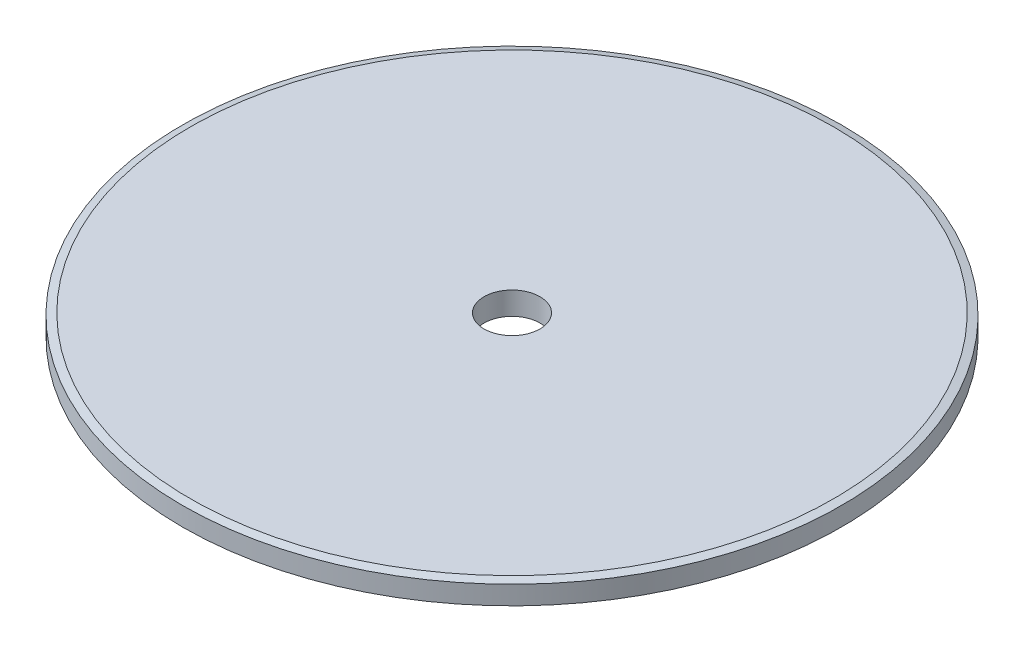
ISO-10303-21;
HEADER;
FILE_DESCRIPTION(('STEP AP214'),'2;1');
FILE_NAME('part.step','',(''),(''),'','','');
FILE_SCHEMA(('AUTOMOTIVE_DESIGN { 1 0 10303 214 1 1 1 1 }'));
ENDSEC;
DATA;
#1=APPLICATION_CONTEXT('core data for automotive mechanical design processes');
#2=APPLICATION_PROTOCOL_DEFINITION('international standard','automotive_design',2000,#1);
#3=PRODUCT_CONTEXT('',#1,'mechanical');
#4=PRODUCT('Part','Part','',(#3));
#5=PRODUCT_RELATED_PRODUCT_CATEGORY('part','',(#4));
#6=PRODUCT_DEFINITION_FORMATION('','',#4);
#7=PRODUCT_DEFINITION_CONTEXT('part definition',#1,'design');
#8=PRODUCT_DEFINITION('design','',#6,#7);
#9=PRODUCT_DEFINITION_SHAPE('','',#8);
#10=(LENGTH_UNIT() NAMED_UNIT(*) SI_UNIT(.MILLI.,.METRE.));
#11=(NAMED_UNIT(*) PLANE_ANGLE_UNIT() SI_UNIT($,.RADIAN.));
#12=(NAMED_UNIT(*) SI_UNIT($,.STERADIAN.) SOLID_ANGLE_UNIT());
#13=UNCERTAINTY_MEASURE_WITH_UNIT(LENGTH_MEASURE(1.E-05),#10,'distance_accuracy_value','');
#14=(GEOMETRIC_REPRESENTATION_CONTEXT(3) GLOBAL_UNCERTAINTY_ASSIGNED_CONTEXT((#13)) GLOBAL_UNIT_ASSIGNED_CONTEXT((#10,
#11,#12)) REPRESENTATION_CONTEXT('',''));
#15=CARTESIAN_POINT('',(0.,0.,0.));
#16=DIRECTION('',(0.,0.,1.));
#17=DIRECTION('',(1.,0.,0.));
#18=AXIS2_PLACEMENT_3D('',#15,#16,#17);
#19=CARTESIAN_POINT('',(0.,0.,0.));
#20=DIRECTION('',(0.,1.,0.));
#21=DIRECTION('',(0.,0.,1.));
#22=AXIS2_PLACEMENT_3D('',#19,#20,#21);
#23=PLANE('',#22);
#24=CARTESIAN_POINT('',(0.,0.,0.));
#25=DIRECTION('',(0.,-1.,0.));
#26=DIRECTION('',(1.,0.,0.));
#27=AXIS2_PLACEMENT_3D('',#24,#25,#26);
#28=CIRCLE('',#27,6.);
#29=CARTESIAN_POINT('',(6.,0.,0.));
#30=VERTEX_POINT('',#29);
#31=EDGE_CURVE('E65',#30,#30,#28,.T.);
#32=ORIENTED_EDGE('',*,*,#31,.F.);
#33=EDGE_LOOP('',(#32));
#34=FACE_BOUND('',#33,.T.);
#35=CARTESIAN_POINT('',(0.,0.,0.));
#36=DIRECTION('',(0.,1.,0.));
#37=DIRECTION('',(0.,0.,1.));
#38=AXIS2_PLACEMENT_3D('',#35,#36,#37);
#39=CIRCLE('',#38,69.055);
#40=CARTESIAN_POINT('',(0.,0.,69.055));
#41=VERTEX_POINT('',#40);
#42=EDGE_CURVE('E10',#41,#41,#39,.F.);
#43=ORIENTED_EDGE('',*,*,#42,.T.);
#44=EDGE_LOOP('',(#43));
#45=FACE_BOUND('',#44,.T.);
#46=ADVANCED_FACE('F39',(#34,#45),#23,.F.);
#47=CARTESIAN_POINT('',(0.,4.89999999999999,0.));
#48=DIRECTION('',(0.,1.,0.));
#49=DIRECTION('',(0.,0.,1.));
#50=AXIS2_PLACEMENT_3D('',#47,#48,#49);
#51=CYLINDRICAL_SURFACE('',#50,70.7);
#52=CARTESIAN_POINT('',(0.,0.440776421549195,0.));
#53=DIRECTION('',(0.,1.,0.));
#54=DIRECTION('',(0.,0.,1.));
#55=AXIS2_PLACEMENT_3D('',#52,#53,#54);
#56=CIRCLE('',#55,70.7);
#57=CARTESIAN_POINT('',(0.,0.440776421549195,70.7));
#58=VERTEX_POINT('',#57);
#59=EDGE_CURVE('E48',#58,#58,#56,.T.);
#60=ORIENTED_EDGE('',*,*,#59,.T.);
#61=EDGE_LOOP('',(#60));
#62=FACE_BOUND('',#61,.T.);
#63=CARTESIAN_POINT('',(0.,4.45922357845081,0.));
#64=DIRECTION('',(0.,-1.,0.));
#65=DIRECTION('',(0.,0.,-1.));
#66=AXIS2_PLACEMENT_3D('',#63,#64,#65);
#67=CIRCLE('',#66,70.7);
#68=CARTESIAN_POINT('',(0.,4.45922357845081,-70.7));
#69=VERTEX_POINT('',#68);
#70=EDGE_CURVE('E53',#69,#69,#67,.T.);
#71=ORIENTED_EDGE('',*,*,#70,.T.);
#72=EDGE_LOOP('',(#71));
#73=FACE_BOUND('',#72,.T.);
#74=ADVANCED_FACE('F83',(#62,#73),#51,.T.);
#75=CARTESIAN_POINT('',(70.7,4.9,0.));
#76=DIRECTION('',(0.,-1.,0.));
#77=DIRECTION('',(0.,0.,-1.));
#78=AXIS2_PLACEMENT_3D('',#75,#76,#77);
#79=PLANE('',#78);
#80=CARTESIAN_POINT('',(0.,4.9,0.));
#81=DIRECTION('',(0.,-1.,0.));
#82=DIRECTION('',(1.,0.,0.));
#83=AXIS2_PLACEMENT_3D('',#80,#81,#82);
#84=CIRCLE('',#83,6.);
#85=CARTESIAN_POINT('',(6.,4.9,0.));
#86=VERTEX_POINT('',#85);
#87=EDGE_CURVE('E64',#86,#86,#84,.T.);
#88=ORIENTED_EDGE('',*,*,#87,.T.);
#89=EDGE_LOOP('',(#88));
#90=FACE_BOUND('',#89,.T.);
#91=CARTESIAN_POINT('',(0.,4.9,0.));
#92=DIRECTION('',(0.,-1.,0.));
#93=DIRECTION('',(0.,0.,-1.));
#94=AXIS2_PLACEMENT_3D('',#91,#92,#93);
#95=CIRCLE('',#94,69.055);
#96=CARTESIAN_POINT('',(0.,4.9,-69.055));
#97=VERTEX_POINT('',#96);
#98=EDGE_CURVE('E58',#97,#97,#95,.F.);
#99=ORIENTED_EDGE('',*,*,#98,.T.);
#100=EDGE_LOOP('',(#99));
#101=FACE_BOUND('',#100,.T.);
#102=ADVANCED_FACE('F73',(#90,#101),#79,.F.);
#103=CARTESIAN_POINT('',(0.,4.9,0.));
#104=DIRECTION('',(0.,-1.,0.));
#105=DIRECTION('',(0.,0.,-1.));
#106=AXIS2_PLACEMENT_3D('',#103,#104,#105);
#107=CONICAL_SURFACE('',#106,69.055,1.30899693899575);
#108=ORIENTED_EDGE('',*,*,#70,.F.);
#109=EDGE_LOOP('',(#108));
#110=FACE_BOUND('',#109,.T.);
#111=ORIENTED_EDGE('',*,*,#98,.F.);
#112=EDGE_LOOP('',(#111));
#113=FACE_BOUND('',#112,.T.);
#114=ADVANCED_FACE('F91',(#110,#113),#107,.T.);
#115=CARTESIAN_POINT('',(0.,0.440776421549195,0.));
#116=DIRECTION('',(0.,1.,0.));
#117=DIRECTION('',(0.,0.,1.));
#118=AXIS2_PLACEMENT_3D('',#115,#116,#117);
#119=CONICAL_SURFACE('',#118,70.7,1.30899693899575);
#120=ORIENTED_EDGE('',*,*,#42,.F.);
#121=EDGE_LOOP('',(#120));
#122=FACE_BOUND('',#121,.T.);
#123=ORIENTED_EDGE('',*,*,#59,.F.);
#124=EDGE_LOOP('',(#123));
#125=FACE_BOUND('',#124,.T.);
#126=ADVANCED_FACE('F42',(#122,#125),#119,.T.);
#127=CARTESIAN_POINT('',(0.,4.9,0.));
#128=DIRECTION('',(0.,-1.,0.));
#129=DIRECTION('',(1.,0.,0.));
#130=AXIS2_PLACEMENT_3D('',#127,#128,#129);
#131=CYLINDRICAL_SURFACE('',#130,6.);
#132=ORIENTED_EDGE('',*,*,#87,.F.);
#133=EDGE_LOOP('',(#132));
#134=FACE_BOUND('',#133,.T.);
#135=ORIENTED_EDGE('',*,*,#31,.T.);
#136=EDGE_LOOP('',(#135));
#137=FACE_BOUND('',#136,.T.);
#138=ADVANCED_FACE('F76',(#134,#137),#131,.F.);
#139=CLOSED_SHELL('',(#46,#74,#102,#114,#126,#138));
#140=MANIFOLD_SOLID_BREP('B2',#139);
#141=ADVANCED_BREP_SHAPE_REPRESENTATION('',(#18,#140),#14);
#142=SHAPE_DEFINITION_REPRESENTATION(#9,#141);
ENDSEC;
END-ISO-10303-21;
